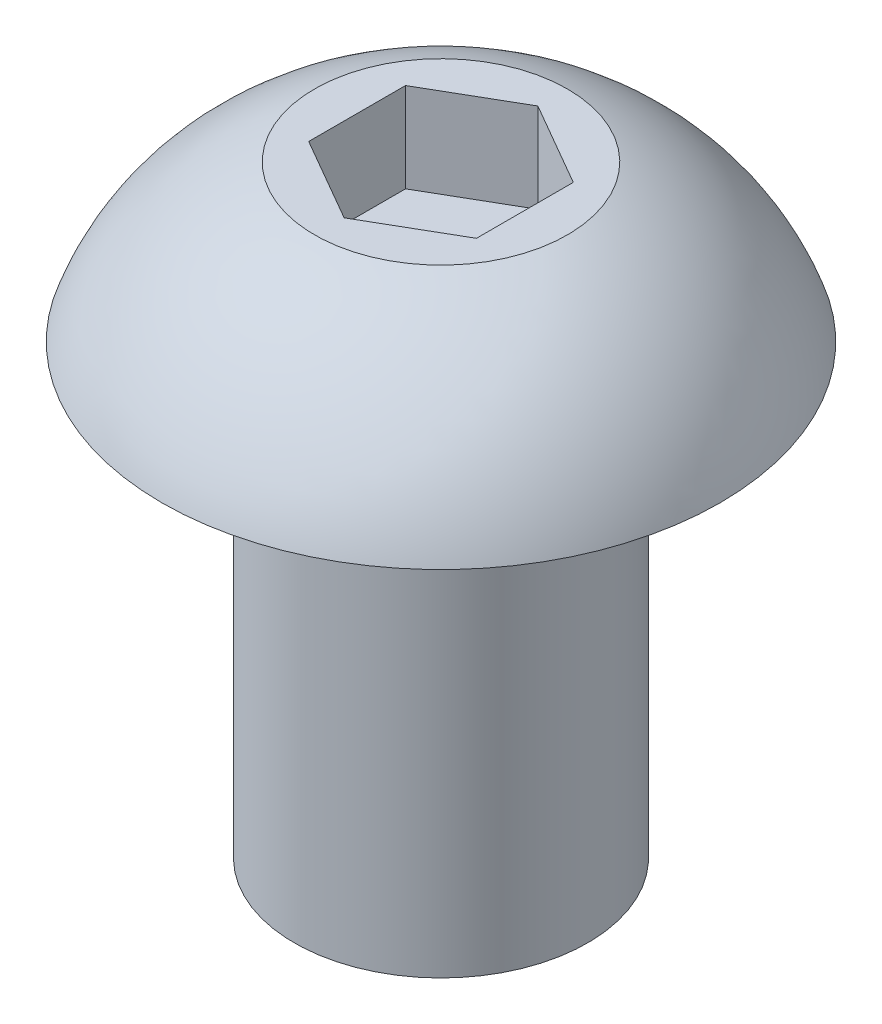
ISO-10303-21;
HEADER;
FILE_DESCRIPTION(('STEP AP214'),'2;1');
FILE_NAME('part.step','',(''),(''),'','','');
FILE_SCHEMA(('AUTOMOTIVE_DESIGN { 1 0 10303 214 1 1 1 1 }'));
ENDSEC;
DATA;
#1=APPLICATION_CONTEXT('core data for automotive mechanical design processes');
#2=APPLICATION_PROTOCOL_DEFINITION('international standard','automotive_design',2000,#1);
#3=PRODUCT_CONTEXT('',#1,'mechanical');
#4=PRODUCT('Part','Part','',(#3));
#5=PRODUCT_RELATED_PRODUCT_CATEGORY('part','',(#4));
#6=PRODUCT_DEFINITION_FORMATION('','',#4);
#7=PRODUCT_DEFINITION_CONTEXT('part definition',#1,'design');
#8=PRODUCT_DEFINITION('design','',#6,#7);
#9=PRODUCT_DEFINITION_SHAPE('','',#8);
#10=(LENGTH_UNIT() NAMED_UNIT(*) SI_UNIT(.MILLI.,.METRE.));
#11=(NAMED_UNIT(*) PLANE_ANGLE_UNIT() SI_UNIT($,.RADIAN.));
#12=(NAMED_UNIT(*) SI_UNIT($,.STERADIAN.) SOLID_ANGLE_UNIT());
#13=UNCERTAINTY_MEASURE_WITH_UNIT(LENGTH_MEASURE(1.E-05),#10,'distance_accuracy_value','');
#14=(GEOMETRIC_REPRESENTATION_CONTEXT(3) GLOBAL_UNCERTAINTY_ASSIGNED_CONTEXT((#13)) GLOBAL_UNIT_ASSIGNED_CONTEXT((#10,
#11,#12)) REPRESENTATION_CONTEXT('',''));
#15=CARTESIAN_POINT('',(0.,0.,0.));
#16=DIRECTION('',(0.,0.,1.));
#17=DIRECTION('',(1.,0.,0.));
#18=AXIS2_PLACEMENT_3D('',#15,#16,#17);
#19=CARTESIAN_POINT('',(0.,-6.35,0.));
#20=DIRECTION('',(0.,-1.,0.));
#21=DIRECTION('',(0.,0.,-1.));
#22=AXIS2_PLACEMENT_3D('',#19,#20,#21);
#23=CYLINDRICAL_SURFACE('',#22,2.0828);
#24=CARTESIAN_POINT('',(0.,-6.35,0.));
#25=DIRECTION('',(0.,-1.,0.));
#26=DIRECTION('',(0.,0.,-1.));
#27=AXIS2_PLACEMENT_3D('',#24,#25,#26);
#28=CIRCLE('',#27,2.0828);
#29=CARTESIAN_POINT('',(0.,-6.35,-2.0828));
#30=VERTEX_POINT('',#29);
#31=EDGE_CURVE('E149',#30,#30,#28,.T.);
#32=ORIENTED_EDGE('',*,*,#31,.F.);
#33=EDGE_LOOP('',(#32));
#34=FACE_BOUND('',#33,.T.);
#35=CARTESIAN_POINT('',(0.,0.,0.));
#36=DIRECTION('',(0.,-1.,0.));
#37=DIRECTION('',(0.,0.,-1.));
#38=AXIS2_PLACEMENT_3D('',#35,#36,#37);
#39=CIRCLE('',#38,2.0828);
#40=CARTESIAN_POINT('',(0.,0.,-2.0828));
#41=VERTEX_POINT('',#40);
#42=EDGE_CURVE('E13',#41,#41,#39,.T.);
#43=ORIENTED_EDGE('',*,*,#42,.T.);
#44=EDGE_LOOP('',(#43));
#45=FACE_BOUND('',#44,.T.);
#46=ADVANCED_FACE('F48',(#34,#45),#23,.T.);
#47=CARTESIAN_POINT('',(-2.0828,0.,0.));
#48=DIRECTION('',(0.,1.,0.));
#49=DIRECTION('',(0.,0.,1.));
#50=AXIS2_PLACEMENT_3D('',#47,#48,#49);
#51=PLANE('',#50);
#52=ORIENTED_EDGE('',*,*,#42,.F.);
#53=EDGE_LOOP('',(#52));
#54=FACE_BOUND('',#53,.T.);
#55=CARTESIAN_POINT('',(0.,0.,0.));
#56=DIRECTION('',(0.,-1.,0.));
#57=DIRECTION('',(0.,0.,-1.));
#58=AXIS2_PLACEMENT_3D('',#55,#56,#57);
#59=CIRCLE('',#58,3.9624);
#60=CARTESIAN_POINT('',(0.,0.,-3.9624));
#61=VERTEX_POINT('',#60);
#62=EDGE_CURVE('E55',#61,#61,#59,.T.);
#63=ORIENTED_EDGE('',*,*,#62,.T.);
#64=EDGE_LOOP('',(#63));
#65=FACE_BOUND('',#64,.T.);
#66=ADVANCED_FACE('F162',(#54,#65),#51,.F.);
#67=CARTESIAN_POINT('',(0.,-1.14110107621728,0.));
#68=DIRECTION('',(0.,-1.,0.));
#69=DIRECTION('',(0.,0.,-1.));
#70=AXIS2_PLACEMENT_3D('',#67,#68,#69);
#71=DEGENERATE_TOROIDAL_SURFACE('',#70,0.588889242879197,3.5612759643917,.T.);
#72=ORIENTED_EDGE('',*,*,#62,.F.);
#73=EDGE_LOOP('',(#72));
#74=FACE_BOUND('',#73,.T.);
#75=CARTESIAN_POINT('',(0.,2.2098,0.));
#76=DIRECTION('',(0.,-1.,0.));
#77=DIRECTION('',(0.,0.,-1.));
#78=AXIS2_PLACEMENT_3D('',#75,#76,#77);
#79=CIRCLE('',#78,1.7947700296736);
#80=CARTESIAN_POINT('',(0.,2.2098,-1.7947700296736));
#81=VERTEX_POINT('',#80);
#82=EDGE_CURVE('E157',#81,#81,#79,.T.);
#83=ORIENTED_EDGE('',*,*,#82,.T.);
#84=EDGE_LOOP('',(#83));
#85=FACE_BOUND('',#84,.T.);
#86=ADVANCED_FACE('F164',(#74,#85),#71,.T.);
#87=CARTESIAN_POINT('',(0.,2.2098,0.));
#88=DIRECTION('',(0.,-1.,0.));
#89=DIRECTION('',(0.,0.,-1.));
#90=AXIS2_PLACEMENT_3D('',#87,#88,#89);
#91=PLANE('',#90);
#92=DIRECTION('',(0.,0.,1.));
#93=VECTOR('',#92,1.);
#94=CARTESIAN_POINT('',(-1.190625,2.2098,-0.687407664253898));
#95=LINE('',#94,#93);
#96=CARTESIAN_POINT('',(-1.190625,2.2098,-0.687407664253898));
#97=VERTEX_POINT('',#96);
#98=CARTESIAN_POINT('',(-1.190625,2.2098,0.687407664253898));
#99=VERTEX_POINT('',#98);
#100=EDGE_CURVE('E136',#97,#99,#95,.T.);
#101=ORIENTED_EDGE('',*,*,#100,.F.);
#102=DIRECTION('',(-0.866025403784439,0.,0.5));
#103=VECTOR('',#102,1.);
#104=CARTESIAN_POINT('',(0.,2.2098,-1.3748153285078));
#105=LINE('',#104,#103);
#106=CARTESIAN_POINT('',(0.,2.2098,-1.3748153285078));
#107=VERTEX_POINT('',#106);
#108=EDGE_CURVE('E62',#107,#97,#105,.T.);
#109=ORIENTED_EDGE('',*,*,#108,.F.);
#110=DIRECTION('',(-0.866025403784439,0.,-0.5));
#111=VECTOR('',#110,1.);
#112=CARTESIAN_POINT('',(1.190625,2.2098,-0.687407664253898));
#113=LINE('',#112,#111);
#114=CARTESIAN_POINT('',(1.190625,2.2098,-0.687407664253898));
#115=VERTEX_POINT('',#114);
#116=EDGE_CURVE('E145',#115,#107,#113,.T.);
#117=ORIENTED_EDGE('',*,*,#116,.F.);
#118=DIRECTION('',(0.,0.,-1.));
#119=VECTOR('',#118,1.);
#120=CARTESIAN_POINT('',(1.190625,2.2098,0.687407664253898));
#121=LINE('',#120,#119);
#122=CARTESIAN_POINT('',(1.190625,2.2098,0.687407664253898));
#123=VERTEX_POINT('',#122);
#124=EDGE_CURVE('E143',#123,#115,#121,.T.);
#125=ORIENTED_EDGE('',*,*,#124,.F.);
#126=DIRECTION('',(0.866025403784438,0.,-0.5));
#127=VECTOR('',#126,1.);
#128=CARTESIAN_POINT('',(0.,2.2098,1.3748153285078));
#129=LINE('',#128,#127);
#130=CARTESIAN_POINT('',(0.,2.2098,1.3748153285078));
#131=VERTEX_POINT('',#130);
#132=EDGE_CURVE('E110',#131,#123,#129,.T.);
#133=ORIENTED_EDGE('',*,*,#132,.F.);
#134=DIRECTION('',(0.866025403784439,0.,0.5));
#135=VECTOR('',#134,1.);
#136=CARTESIAN_POINT('',(-1.190625,2.2098,0.687407664253898));
#137=LINE('',#136,#135);
#138=EDGE_CURVE('E139',#99,#131,#137,.T.);
#139=ORIENTED_EDGE('',*,*,#138,.F.);
#140=EDGE_LOOP('',(#101,#109,#117,#125,#133,#139));
#141=FACE_BOUND('',#140,.T.);
#142=ORIENTED_EDGE('',*,*,#82,.F.);
#143=EDGE_LOOP('',(#142));
#144=FACE_BOUND('',#143,.T.);
#145=ADVANCED_FACE('F167',(#141,#144),#91,.F.);
#146=CARTESIAN_POINT('',(-2.0828,-6.35,0.));
#147=DIRECTION('',(0.,1.,0.));
#148=DIRECTION('',(0.,0.,1.));
#149=AXIS2_PLACEMENT_3D('',#146,#147,#148);
#150=PLANE('',#149);
#151=ORIENTED_EDGE('',*,*,#31,.T.);
#152=EDGE_LOOP('',(#151));
#153=FACE_BOUND('',#152,.T.);
#154=ADVANCED_FACE('F172',(#153),#150,.F.);
#155=CARTESIAN_POINT('',(0.,0.939799999999999,-1.3748153285078));
#156=DIRECTION('',(-0.5,0.,-0.866025403784439));
#157=DIRECTION('',(-0.866025403784439,0.,0.5));
#158=AXIS2_PLACEMENT_3D('',#155,#156,#157);
#159=PLANE('',#158);
#160=ORIENTED_EDGE('',*,*,#108,.T.);
#161=DIRECTION('',(0.,1.,0.));
#162=VECTOR('',#161,1.);
#163=CARTESIAN_POINT('',(-1.190625,0.939799999999999,-0.687407664253898));
#164=LINE('',#163,#162);
#165=CARTESIAN_POINT('',(-1.190625,0.939799999999999,-0.687407664253898));
#166=VERTEX_POINT('',#165);
#167=EDGE_CURVE('E92',#166,#97,#164,.T.);
#168=ORIENTED_EDGE('',*,*,#167,.F.);
#169=DIRECTION('',(-0.866025403784439,0.,0.5));
#170=VECTOR('',#169,1.);
#171=CARTESIAN_POINT('',(0.,0.939799999999999,-1.3748153285078));
#172=LINE('',#171,#170);
#173=CARTESIAN_POINT('',(0.,0.939799999999999,-1.3748153285078));
#174=VERTEX_POINT('',#173);
#175=EDGE_CURVE('E147',#174,#166,#172,.T.);
#176=ORIENTED_EDGE('',*,*,#175,.F.);
#177=DIRECTION('',(0.,1.,0.));
#178=VECTOR('',#177,1.);
#179=CARTESIAN_POINT('',(0.,0.939799999999999,-1.3748153285078));
#180=LINE('',#179,#178);
#181=EDGE_CURVE('E70',#174,#107,#180,.T.);
#182=ORIENTED_EDGE('',*,*,#181,.T.);
#183=EDGE_LOOP('',(#160,#168,#176,#182));
#184=FACE_BOUND('',#183,.T.);
#185=ADVANCED_FACE('F178',(#184),#159,.F.);
#186=CARTESIAN_POINT('',(1.190625,0.939799999999999,-0.687407664253898));
#187=DIRECTION('',(0.5,0.,-0.866025403784439));
#188=DIRECTION('',(-0.866025403784439,0.,-0.5));
#189=AXIS2_PLACEMENT_3D('',#186,#187,#188);
#190=PLANE('',#189);
#191=ORIENTED_EDGE('',*,*,#116,.T.);
#192=ORIENTED_EDGE('',*,*,#181,.F.);
#193=DIRECTION('',(-0.866025403784439,0.,-0.5));
#194=VECTOR('',#193,1.);
#195=CARTESIAN_POINT('',(1.190625,0.939799999999999,-0.687407664253898));
#196=LINE('',#195,#194);
#197=CARTESIAN_POINT('',(1.190625,0.939799999999999,-0.687407664253898));
#198=VERTEX_POINT('',#197);
#199=EDGE_CURVE('E122',#198,#174,#196,.T.);
#200=ORIENTED_EDGE('',*,*,#199,.F.);
#201=DIRECTION('',(0.,1.,0.));
#202=VECTOR('',#201,1.);
#203=CARTESIAN_POINT('',(1.190625,0.939799999999999,-0.687407664253898));
#204=LINE('',#203,#202);
#205=EDGE_CURVE('E114',#198,#115,#204,.T.);
#206=ORIENTED_EDGE('',*,*,#205,.T.);
#207=EDGE_LOOP('',(#191,#192,#200,#206));
#208=FACE_BOUND('',#207,.T.);
#209=ADVANCED_FACE('F216',(#208),#190,.F.);
#210=CARTESIAN_POINT('',(1.190625,0.939799999999999,0.687407664253898));
#211=DIRECTION('',(1.,0.,0.));
#212=DIRECTION('',(0.,0.,-1.));
#213=AXIS2_PLACEMENT_3D('',#210,#211,#212);
#214=PLANE('',#213);
#215=ORIENTED_EDGE('',*,*,#124,.T.);
#216=ORIENTED_EDGE('',*,*,#205,.F.);
#217=DIRECTION('',(0.,0.,-1.));
#218=VECTOR('',#217,1.);
#219=CARTESIAN_POINT('',(1.190625,0.939799999999999,0.687407664253898));
#220=LINE('',#219,#218);
#221=CARTESIAN_POINT('',(1.190625,0.939799999999999,0.687407664253898));
#222=VERTEX_POINT('',#221);
#223=EDGE_CURVE('E118',#222,#198,#220,.T.);
#224=ORIENTED_EDGE('',*,*,#223,.F.);
#225=DIRECTION('',(0.,1.,0.));
#226=VECTOR('',#225,1.);
#227=CARTESIAN_POINT('',(1.190625,0.939799999999999,0.687407664253898));
#228=LINE('',#227,#226);
#229=EDGE_CURVE('E103',#222,#123,#228,.T.);
#230=ORIENTED_EDGE('',*,*,#229,.T.);
#231=EDGE_LOOP('',(#215,#216,#224,#230));
#232=FACE_BOUND('',#231,.T.);
#233=ADVANCED_FACE('F119',(#232),#214,.F.);
#234=CARTESIAN_POINT('',(0.,0.939799999999999,1.3748153285078));
#235=DIRECTION('',(0.5,0.,0.866025403784438));
#236=DIRECTION('',(0.866025403784439,0.,-0.5));
#237=AXIS2_PLACEMENT_3D('',#234,#235,#236);
#238=PLANE('',#237);
#239=ORIENTED_EDGE('',*,*,#132,.T.);
#240=ORIENTED_EDGE('',*,*,#229,.F.);
#241=DIRECTION('',(0.866025403784438,0.,-0.5));
#242=VECTOR('',#241,1.);
#243=CARTESIAN_POINT('',(0.,0.939799999999999,1.3748153285078));
#244=LINE('',#243,#242);
#245=CARTESIAN_POINT('',(0.,0.939799999999999,1.3748153285078));
#246=VERTEX_POINT('',#245);
#247=EDGE_CURVE('E107',#246,#222,#244,.T.);
#248=ORIENTED_EDGE('',*,*,#247,.F.);
#249=DIRECTION('',(0.,1.,0.));
#250=VECTOR('',#249,1.);
#251=CARTESIAN_POINT('',(0.,0.939799999999999,1.3748153285078));
#252=LINE('',#251,#250);
#253=EDGE_CURVE('E115',#246,#131,#252,.T.);
#254=ORIENTED_EDGE('',*,*,#253,.T.);
#255=EDGE_LOOP('',(#239,#240,#248,#254));
#256=FACE_BOUND('',#255,.T.);
#257=ADVANCED_FACE('F105',(#256),#238,.F.);
#258=CARTESIAN_POINT('',(-1.190625,0.939799999999999,0.687407664253898));
#259=DIRECTION('',(-0.5,0.,0.866025403784439));
#260=DIRECTION('',(0.866025403784439,0.,0.5));
#261=AXIS2_PLACEMENT_3D('',#258,#259,#260);
#262=PLANE('',#261);
#263=ORIENTED_EDGE('',*,*,#138,.T.);
#264=ORIENTED_EDGE('',*,*,#253,.F.);
#265=DIRECTION('',(0.866025403784439,0.,0.5));
#266=VECTOR('',#265,1.);
#267=CARTESIAN_POINT('',(-1.190625,0.939799999999999,0.687407664253898));
#268=LINE('',#267,#266);
#269=CARTESIAN_POINT('',(-1.190625,0.939799999999999,0.687407664253898));
#270=VERTEX_POINT('',#269);
#271=EDGE_CURVE('E128',#270,#246,#268,.T.);
#272=ORIENTED_EDGE('',*,*,#271,.F.);
#273=DIRECTION('',(0.,1.,0.));
#274=VECTOR('',#273,1.);
#275=CARTESIAN_POINT('',(-1.190625,0.939799999999999,0.687407664253898));
#276=LINE('',#275,#274);
#277=EDGE_CURVE('E152',#270,#99,#276,.T.);
#278=ORIENTED_EDGE('',*,*,#277,.T.);
#279=EDGE_LOOP('',(#263,#264,#272,#278));
#280=FACE_BOUND('',#279,.T.);
#281=ADVANCED_FACE('F241',(#280),#262,.F.);
#282=CARTESIAN_POINT('',(-1.190625,0.939799999999999,-0.687407664253898));
#283=DIRECTION('',(-1.,0.,0.));
#284=DIRECTION('',(0.,0.,1.));
#285=AXIS2_PLACEMENT_3D('',#282,#283,#284);
#286=PLANE('',#285);
#287=ORIENTED_EDGE('',*,*,#100,.T.);
#288=ORIENTED_EDGE('',*,*,#277,.F.);
#289=DIRECTION('',(0.,0.,1.));
#290=VECTOR('',#289,1.);
#291=CARTESIAN_POINT('',(-1.190625,0.939799999999999,-0.687407664253898));
#292=LINE('',#291,#290);
#293=EDGE_CURVE('E130',#166,#270,#292,.T.);
#294=ORIENTED_EDGE('',*,*,#293,.F.);
#295=ORIENTED_EDGE('',*,*,#167,.T.);
#296=EDGE_LOOP('',(#287,#288,#294,#295));
#297=FACE_BOUND('',#296,.T.);
#298=ADVANCED_FACE('F250',(#297),#286,.F.);
#299=CARTESIAN_POINT('',(0.,0.939799999999999,0.));
#300=DIRECTION('',(0.,1.,0.));
#301=DIRECTION('',(0.,0.,1.));
#302=AXIS2_PLACEMENT_3D('',#299,#300,#301);
#303=PLANE('',#302);
#304=ORIENTED_EDGE('',*,*,#175,.T.);
#305=ORIENTED_EDGE('',*,*,#293,.T.);
#306=ORIENTED_EDGE('',*,*,#271,.T.);
#307=ORIENTED_EDGE('',*,*,#247,.T.);
#308=ORIENTED_EDGE('',*,*,#223,.T.);
#309=ORIENTED_EDGE('',*,*,#199,.T.);
#310=EDGE_LOOP('',(#304,#305,#306,#307,#308,#309));
#311=FACE_BOUND('',#310,.T.);
#312=ADVANCED_FACE('F125',(#311),#303,.T.);
#313=CLOSED_SHELL('',(#46,#66,#86,#145,#154,#185,#209,#233,#257,#281,#298,#312));
#314=MANIFOLD_SOLID_BREP('B2',#313);
#315=ADVANCED_BREP_SHAPE_REPRESENTATION('',(#18,#314),#14);
#316=SHAPE_DEFINITION_REPRESENTATION(#9,#315);
ENDSEC;
END-ISO-10303-21;
